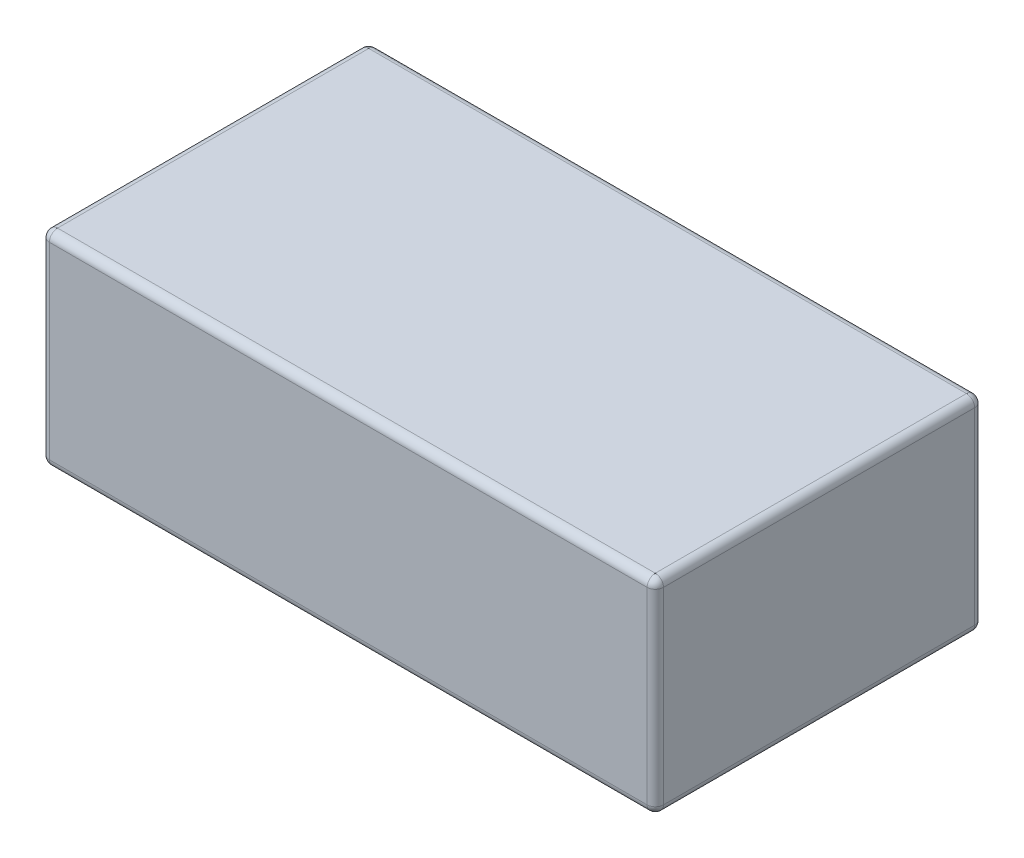
ISO-10303-21;
HEADER;
FILE_DESCRIPTION(('STEP AP214'),'2;1');
FILE_NAME('part.step','',(''),(''),'','','');
FILE_SCHEMA(('AUTOMOTIVE_DESIGN { 1 0 10303 214 1 1 1 1 }'));
ENDSEC;
DATA;
#1=APPLICATION_CONTEXT('core data for automotive mechanical design processes');
#2=APPLICATION_PROTOCOL_DEFINITION('international standard','automotive_design',2000,#1);
#3=PRODUCT_CONTEXT('',#1,'mechanical');
#4=PRODUCT('Part','Part','',(#3));
#5=PRODUCT_RELATED_PRODUCT_CATEGORY('part','',(#4));
#6=PRODUCT_DEFINITION_FORMATION('','',#4);
#7=PRODUCT_DEFINITION_CONTEXT('part definition',#1,'design');
#8=PRODUCT_DEFINITION('design','',#6,#7);
#9=PRODUCT_DEFINITION_SHAPE('','',#8);
#10=(LENGTH_UNIT() NAMED_UNIT(*) SI_UNIT(.MILLI.,.METRE.));
#11=(NAMED_UNIT(*) PLANE_ANGLE_UNIT() SI_UNIT($,.RADIAN.));
#12=(NAMED_UNIT(*) SI_UNIT($,.STERADIAN.) SOLID_ANGLE_UNIT());
#13=UNCERTAINTY_MEASURE_WITH_UNIT(LENGTH_MEASURE(1.E-05),#10,'distance_accuracy_value','');
#14=(GEOMETRIC_REPRESENTATION_CONTEXT(3) GLOBAL_UNCERTAINTY_ASSIGNED_CONTEXT((#13)) GLOBAL_UNIT_ASSIGNED_CONTEXT((#10,
#11,#12)) REPRESENTATION_CONTEXT('',''));
#15=CARTESIAN_POINT('',(0.,0.,0.));
#16=DIRECTION('',(0.,0.,1.));
#17=DIRECTION('',(1.,0.,0.));
#18=AXIS2_PLACEMENT_3D('',#15,#16,#17);
#19=CARTESIAN_POINT('',(-0.73,0.25,0.38));
#20=DIRECTION('',(0.,-1.,0.));
#21=DIRECTION('',(0.,0.,-1.));
#22=AXIS2_PLACEMENT_3D('',#19,#20,#21);
#23=CYLINDRICAL_SURFACE('',#22,0.02);
#24=DIRECTION('',(0.,-1.,0.));
#25=VECTOR('',#24,1.);
#26=CARTESIAN_POINT('',(-0.73,0.25,0.4));
#27=LINE('',#26,#25);
#28=CARTESIAN_POINT('',(-0.73,0.23,0.4));
#29=VERTEX_POINT('',#28);
#30=CARTESIAN_POINT('',(-0.73,-0.23,0.4));
#31=VERTEX_POINT('',#30);
#32=EDGE_CURVE('E153',#29,#31,#27,.T.);
#33=ORIENTED_EDGE('',*,*,#32,.F.);
#34=CARTESIAN_POINT('',(-0.73,0.23,0.38));
#35=DIRECTION('',(0.,-1.,0.));
#36=DIRECTION('',(0.,0.,-1.));
#37=AXIS2_PLACEMENT_3D('',#34,#35,#36);
#38=CIRCLE('',#37,0.02);
#39=CARTESIAN_POINT('',(-0.75,0.23,0.38));
#40=VERTEX_POINT('',#39);
#41=EDGE_CURVE('E140',#29,#40,#38,.T.);
#42=ORIENTED_EDGE('',*,*,#41,.T.);
#43=DIRECTION('',(0.,-1.,0.));
#44=VECTOR('',#43,1.);
#45=CARTESIAN_POINT('',(-0.75,0.25,0.38));
#46=LINE('',#45,#44);
#47=CARTESIAN_POINT('',(-0.75,-0.23,0.38));
#48=VERTEX_POINT('',#47);
#49=EDGE_CURVE('E211',#40,#48,#46,.T.);
#50=ORIENTED_EDGE('',*,*,#49,.T.);
#51=CARTESIAN_POINT('',(-0.73,-0.23,0.38));
#52=DIRECTION('',(0.,-1.,0.));
#53=DIRECTION('',(0.,0.,-1.));
#54=AXIS2_PLACEMENT_3D('',#51,#52,#53);
#55=CIRCLE('',#54,0.02);
#56=EDGE_CURVE('E191',#48,#31,#55,.F.);
#57=ORIENTED_EDGE('',*,*,#56,.T.);
#58=EDGE_LOOP('',(#33,#42,#50,#57));
#59=FACE_BOUND('',#58,.T.);
#60=ADVANCED_FACE('F35',(#59),#23,.T.);
#61=CARTESIAN_POINT('',(-0.73,0.25,0.4));
#62=DIRECTION('',(0.,0.,-1.));
#63=DIRECTION('',(-1.,0.,0.));
#64=AXIS2_PLACEMENT_3D('',#61,#62,#63);
#65=PLANE('',#64);
#66=DIRECTION('',(0.,-1.,0.));
#67=VECTOR('',#66,1.);
#68=CARTESIAN_POINT('',(0.73,0.25,0.4));
#69=LINE('',#68,#67);
#70=CARTESIAN_POINT('',(0.73,0.23,0.4));
#71=VERTEX_POINT('',#70);
#72=CARTESIAN_POINT('',(0.73,-0.23,0.4));
#73=VERTEX_POINT('',#72);
#74=EDGE_CURVE('E271',#71,#73,#69,.T.);
#75=ORIENTED_EDGE('',*,*,#74,.F.);
#76=DIRECTION('',(1.,0.,0.));
#77=VECTOR('',#76,1.);
#78=CARTESIAN_POINT('',(-0.73,0.23,0.4));
#79=LINE('',#78,#77);
#80=EDGE_CURVE('E189',#71,#29,#79,.F.);
#81=ORIENTED_EDGE('',*,*,#80,.T.);
#82=ORIENTED_EDGE('',*,*,#32,.T.);
#83=DIRECTION('',(1.,0.,0.));
#84=VECTOR('',#83,1.);
#85=CARTESIAN_POINT('',(-0.73,-0.23,0.4));
#86=LINE('',#85,#84);
#87=EDGE_CURVE('E186',#31,#73,#86,.T.);
#88=ORIENTED_EDGE('',*,*,#87,.T.);
#89=EDGE_LOOP('',(#75,#81,#82,#88));
#90=FACE_BOUND('',#89,.T.);
#91=ADVANCED_FACE('F313',(#90),#65,.F.);
#92=CARTESIAN_POINT('',(0.73,0.25,0.38));
#93=DIRECTION('',(0.,-1.,0.));
#94=DIRECTION('',(0.,0.,-1.));
#95=AXIS2_PLACEMENT_3D('',#92,#93,#94);
#96=CYLINDRICAL_SURFACE('',#95,0.0200000000000001);
#97=DIRECTION('',(0.,-1.,0.));
#98=VECTOR('',#97,1.);
#99=CARTESIAN_POINT('',(0.75,0.25,0.38));
#100=LINE('',#99,#98);
#101=CARTESIAN_POINT('',(0.75,0.23,0.38));
#102=VERTEX_POINT('',#101);
#103=CARTESIAN_POINT('',(0.75,-0.23,0.38));
#104=VERTEX_POINT('',#103);
#105=EDGE_CURVE('E268',#102,#104,#100,.T.);
#106=ORIENTED_EDGE('',*,*,#105,.F.);
#107=CARTESIAN_POINT('',(0.73,0.23,0.38));
#108=DIRECTION('',(0.,-1.,0.));
#109=DIRECTION('',(0.,0.,-1.));
#110=AXIS2_PLACEMENT_3D('',#107,#108,#109);
#111=CIRCLE('',#110,0.0200000000000001);
#112=EDGE_CURVE('E184',#102,#71,#111,.T.);
#113=ORIENTED_EDGE('',*,*,#112,.T.);
#114=ORIENTED_EDGE('',*,*,#74,.T.);
#115=CARTESIAN_POINT('',(0.73,-0.23,0.38));
#116=DIRECTION('',(0.,-1.,0.));
#117=DIRECTION('',(0.,0.,-1.));
#118=AXIS2_PLACEMENT_3D('',#115,#116,#117);
#119=CIRCLE('',#118,0.0200000000000001);
#120=EDGE_CURVE('E182',#73,#104,#119,.F.);
#121=ORIENTED_EDGE('',*,*,#120,.T.);
#122=EDGE_LOOP('',(#106,#113,#114,#121));
#123=FACE_BOUND('',#122,.T.);
#124=ADVANCED_FACE('F314',(#123),#96,.T.);
#125=CARTESIAN_POINT('',(0.75,0.25,0.38));
#126=DIRECTION('',(-1.,0.,0.));
#127=DIRECTION('',(0.,0.,1.));
#128=AXIS2_PLACEMENT_3D('',#125,#126,#127);
#129=PLANE('',#128);
#130=DIRECTION('',(0.,-1.,0.));
#131=VECTOR('',#130,1.);
#132=CARTESIAN_POINT('',(0.75,0.25,-0.38));
#133=LINE('',#132,#131);
#134=CARTESIAN_POINT('',(0.75,0.23,-0.38));
#135=VERTEX_POINT('',#134);
#136=CARTESIAN_POINT('',(0.75,-0.23,-0.38));
#137=VERTEX_POINT('',#136);
#138=EDGE_CURVE('E265',#135,#137,#133,.T.);
#139=ORIENTED_EDGE('',*,*,#138,.F.);
#140=DIRECTION('',(0.,0.,-1.));
#141=VECTOR('',#140,1.);
#142=CARTESIAN_POINT('',(0.75,0.23,0.38));
#143=LINE('',#142,#141);
#144=EDGE_CURVE('E180',#135,#102,#143,.F.);
#145=ORIENTED_EDGE('',*,*,#144,.T.);
#146=ORIENTED_EDGE('',*,*,#105,.T.);
#147=DIRECTION('',(0.,0.,-1.));
#148=VECTOR('',#147,1.);
#149=CARTESIAN_POINT('',(0.75,-0.23,0.38));
#150=LINE('',#149,#148);
#151=EDGE_CURVE('E178',#104,#137,#150,.T.);
#152=ORIENTED_EDGE('',*,*,#151,.T.);
#153=EDGE_LOOP('',(#139,#145,#146,#152));
#154=FACE_BOUND('',#153,.T.);
#155=ADVANCED_FACE('F496',(#154),#129,.F.);
#156=CARTESIAN_POINT('',(0.73,0.25,-0.38));
#157=DIRECTION('',(0.,-1.,0.));
#158=DIRECTION('',(0.,0.,-1.));
#159=AXIS2_PLACEMENT_3D('',#156,#157,#158);
#160=CYLINDRICAL_SURFACE('',#159,0.0200000000000001);
#161=DIRECTION('',(0.,-1.,0.));
#162=VECTOR('',#161,1.);
#163=CARTESIAN_POINT('',(0.73,0.25,-0.4));
#164=LINE('',#163,#162);
#165=CARTESIAN_POINT('',(0.73,0.23,-0.4));
#166=VERTEX_POINT('',#165);
#167=CARTESIAN_POINT('',(0.73,-0.23,-0.4));
#168=VERTEX_POINT('',#167);
#169=EDGE_CURVE('E262',#166,#168,#164,.T.);
#170=ORIENTED_EDGE('',*,*,#169,.F.);
#171=CARTESIAN_POINT('',(0.73,0.23,-0.38));
#172=DIRECTION('',(0.,-1.,0.));
#173=DIRECTION('',(0.,0.,-1.));
#174=AXIS2_PLACEMENT_3D('',#171,#172,#173);
#175=CIRCLE('',#174,0.0200000000000001);
#176=EDGE_CURVE('E176',#166,#135,#175,.T.);
#177=ORIENTED_EDGE('',*,*,#176,.T.);
#178=ORIENTED_EDGE('',*,*,#138,.T.);
#179=CARTESIAN_POINT('',(0.73,-0.23,-0.38));
#180=DIRECTION('',(0.,-1.,0.));
#181=DIRECTION('',(0.,0.,-1.));
#182=AXIS2_PLACEMENT_3D('',#179,#180,#181);
#183=CIRCLE('',#182,0.0200000000000001);
#184=EDGE_CURVE('E174',#137,#168,#183,.F.);
#185=ORIENTED_EDGE('',*,*,#184,.T.);
#186=EDGE_LOOP('',(#170,#177,#178,#185));
#187=FACE_BOUND('',#186,.T.);
#188=ADVANCED_FACE('F488',(#187),#160,.T.);
#189=CARTESIAN_POINT('',(-0.73,0.25,-0.4));
#190=DIRECTION('',(0.,0.,1.));
#191=DIRECTION('',(1.,0.,0.));
#192=AXIS2_PLACEMENT_3D('',#189,#190,#191);
#193=PLANE('',#192);
#194=DIRECTION('',(0.,-1.,0.));
#195=VECTOR('',#194,1.);
#196=CARTESIAN_POINT('',(-0.73,0.25,-0.4));
#197=LINE('',#196,#195);
#198=CARTESIAN_POINT('',(-0.73,0.23,-0.4));
#199=VERTEX_POINT('',#198);
#200=CARTESIAN_POINT('',(-0.73,-0.23,-0.4));
#201=VERTEX_POINT('',#200);
#202=EDGE_CURVE('E257',#199,#201,#197,.T.);
#203=ORIENTED_EDGE('',*,*,#202,.F.);
#204=DIRECTION('',(-1.,0.,0.));
#205=VECTOR('',#204,1.);
#206=CARTESIAN_POINT('',(0.73,0.23,-0.4));
#207=LINE('',#206,#205);
#208=EDGE_CURVE('E172',#199,#166,#207,.F.);
#209=ORIENTED_EDGE('',*,*,#208,.T.);
#210=ORIENTED_EDGE('',*,*,#169,.T.);
#211=DIRECTION('',(-1.,0.,0.));
#212=VECTOR('',#211,1.);
#213=CARTESIAN_POINT('',(-0.73,-0.23,-0.4));
#214=LINE('',#213,#212);
#215=EDGE_CURVE('E170',#168,#201,#214,.T.);
#216=ORIENTED_EDGE('',*,*,#215,.T.);
#217=EDGE_LOOP('',(#203,#209,#210,#216));
#218=FACE_BOUND('',#217,.T.);
#219=ADVANCED_FACE('F294',(#218),#193,.F.);
#220=CARTESIAN_POINT('',(-0.73,0.25,-0.38));
#221=DIRECTION('',(0.,-1.,0.));
#222=DIRECTION('',(0.,0.,-1.));
#223=AXIS2_PLACEMENT_3D('',#220,#221,#222);
#224=CYLINDRICAL_SURFACE('',#223,0.02);
#225=DIRECTION('',(0.,-1.,0.));
#226=VECTOR('',#225,1.);
#227=CARTESIAN_POINT('',(-0.75,0.25,-0.38));
#228=LINE('',#227,#226);
#229=CARTESIAN_POINT('',(-0.75,0.23,-0.38));
#230=VERTEX_POINT('',#229);
#231=CARTESIAN_POINT('',(-0.75,-0.23,-0.38));
#232=VERTEX_POINT('',#231);
#233=EDGE_CURVE('E252',#230,#232,#228,.T.);
#234=ORIENTED_EDGE('',*,*,#233,.F.);
#235=CARTESIAN_POINT('',(-0.73,0.23,-0.38));
#236=DIRECTION('',(0.,-1.,0.));
#237=DIRECTION('',(0.,0.,-1.));
#238=AXIS2_PLACEMENT_3D('',#235,#236,#237);
#239=CIRCLE('',#238,0.02);
#240=EDGE_CURVE('E168',#230,#199,#239,.T.);
#241=ORIENTED_EDGE('',*,*,#240,.T.);
#242=ORIENTED_EDGE('',*,*,#202,.T.);
#243=CARTESIAN_POINT('',(-0.73,-0.23,-0.38));
#244=DIRECTION('',(0.,-1.,0.));
#245=DIRECTION('',(0.,0.,-1.));
#246=AXIS2_PLACEMENT_3D('',#243,#244,#245);
#247=CIRCLE('',#246,0.02);
#248=EDGE_CURVE('E166',#201,#232,#247,.F.);
#249=ORIENTED_EDGE('',*,*,#248,.T.);
#250=EDGE_LOOP('',(#234,#241,#242,#249));
#251=FACE_BOUND('',#250,.T.);
#252=ADVANCED_FACE('F292',(#251),#224,.T.);
#253=CARTESIAN_POINT('',(-0.75,0.25,0.38));
#254=DIRECTION('',(1.,0.,0.));
#255=DIRECTION('',(0.,0.,-1.));
#256=AXIS2_PLACEMENT_3D('',#253,#254,#255);
#257=PLANE('',#256);
#258=ORIENTED_EDGE('',*,*,#49,.F.);
#259=DIRECTION('',(0.,0.,1.));
#260=VECTOR('',#259,1.);
#261=CARTESIAN_POINT('',(-0.75,0.23,-0.38));
#262=LINE('',#261,#260);
#263=EDGE_CURVE('E131',#40,#230,#262,.F.);
#264=ORIENTED_EDGE('',*,*,#263,.T.);
#265=ORIENTED_EDGE('',*,*,#233,.T.);
#266=DIRECTION('',(0.,0.,1.));
#267=VECTOR('',#266,1.);
#268=CARTESIAN_POINT('',(-0.75,-0.23,0.38));
#269=LINE('',#268,#267);
#270=EDGE_CURVE('E159',#232,#48,#269,.T.);
#271=ORIENTED_EDGE('',*,*,#270,.T.);
#272=EDGE_LOOP('',(#258,#264,#265,#271));
#273=FACE_BOUND('',#272,.T.);
#274=ADVANCED_FACE('F250',(#273),#257,.F.);
#275=CARTESIAN_POINT('',(-0.73,0.25,0.38));
#276=DIRECTION('',(0.,1.,0.));
#277=DIRECTION('',(0.,0.,1.));
#278=AXIS2_PLACEMENT_3D('',#275,#276,#277);
#279=PLANE('',#278);
#280=DIRECTION('',(-1.,0.,0.));
#281=VECTOR('',#280,1.);
#282=CARTESIAN_POINT('',(-0.73,0.25,-0.38));
#283=LINE('',#282,#281);
#284=CARTESIAN_POINT('',(0.73,0.25,-0.38));
#285=VERTEX_POINT('',#284);
#286=CARTESIAN_POINT('',(-0.73,0.25,-0.38));
#287=VERTEX_POINT('',#286);
#288=EDGE_CURVE('E157',#285,#287,#283,.T.);
#289=ORIENTED_EDGE('',*,*,#288,.T.);
#290=DIRECTION('',(0.,0.,1.));
#291=VECTOR('',#290,1.);
#292=CARTESIAN_POINT('',(-0.73,0.25,0.38));
#293=LINE('',#292,#291);
#294=CARTESIAN_POINT('',(-0.73,0.25,0.38));
#295=VERTEX_POINT('',#294);
#296=EDGE_CURVE('E129',#287,#295,#293,.T.);
#297=ORIENTED_EDGE('',*,*,#296,.T.);
#298=DIRECTION('',(1.,0.,0.));
#299=VECTOR('',#298,1.);
#300=CARTESIAN_POINT('',(0.73,0.25,0.38));
#301=LINE('',#300,#299);
#302=CARTESIAN_POINT('',(0.73,0.25,0.38));
#303=VERTEX_POINT('',#302);
#304=EDGE_CURVE('E146',#295,#303,#301,.T.);
#305=ORIENTED_EDGE('',*,*,#304,.T.);
#306=DIRECTION('',(0.,0.,-1.));
#307=VECTOR('',#306,1.);
#308=CARTESIAN_POINT('',(0.73,0.25,-0.38));
#309=LINE('',#308,#307);
#310=EDGE_CURVE('E152',#303,#285,#309,.T.);
#311=ORIENTED_EDGE('',*,*,#310,.T.);
#312=EDGE_LOOP('',(#289,#297,#305,#311));
#313=FACE_BOUND('',#312,.T.);
#314=ADVANCED_FACE('F155',(#313),#279,.T.);
#315=CARTESIAN_POINT('',(-0.73,-0.25,0.38));
#316=DIRECTION('',(0.,1.,0.));
#317=DIRECTION('',(0.,0.,1.));
#318=AXIS2_PLACEMENT_3D('',#315,#316,#317);
#319=PLANE('',#318);
#320=DIRECTION('',(0.,0.,-1.));
#321=VECTOR('',#320,1.);
#322=CARTESIAN_POINT('',(0.73,-0.25,0.38));
#323=LINE('',#322,#321);
#324=CARTESIAN_POINT('',(0.73,-0.25,-0.38));
#325=VERTEX_POINT('',#324);
#326=CARTESIAN_POINT('',(0.73,-0.25,0.38));
#327=VERTEX_POINT('',#326);
#328=EDGE_CURVE('E44',#325,#327,#323,.F.);
#329=ORIENTED_EDGE('',*,*,#328,.T.);
#330=DIRECTION('',(1.,0.,0.));
#331=VECTOR('',#330,1.);
#332=CARTESIAN_POINT('',(-0.73,-0.25,0.38));
#333=LINE('',#332,#331);
#334=CARTESIAN_POINT('',(-0.73,-0.25,0.38));
#335=VERTEX_POINT('',#334);
#336=EDGE_CURVE('E11',#327,#335,#333,.F.);
#337=ORIENTED_EDGE('',*,*,#336,.T.);
#338=DIRECTION('',(0.,0.,1.));
#339=VECTOR('',#338,1.);
#340=CARTESIAN_POINT('',(-0.73,-0.25,0.38));
#341=LINE('',#340,#339);
#342=CARTESIAN_POINT('',(-0.73,-0.25,-0.38));
#343=VERTEX_POINT('',#342);
#344=EDGE_CURVE('E194',#335,#343,#341,.F.);
#345=ORIENTED_EDGE('',*,*,#344,.T.);
#346=DIRECTION('',(-1.,0.,0.));
#347=VECTOR('',#346,1.);
#348=CARTESIAN_POINT('',(-0.73,-0.25,-0.38));
#349=LINE('',#348,#347);
#350=EDGE_CURVE('E55',#343,#325,#349,.F.);
#351=ORIENTED_EDGE('',*,*,#350,.T.);
#352=EDGE_LOOP('',(#329,#337,#345,#351));
#353=FACE_BOUND('',#352,.T.);
#354=ADVANCED_FACE('F450',(#353),#319,.F.);
#355=CARTESIAN_POINT('',(0.73,0.23,0.38));
#356=DIRECTION('',(0.,0.,1.));
#357=DIRECTION('',(1.,0.,0.));
#358=AXIS2_PLACEMENT_3D('',#355,#356,#357);
#359=CYLINDRICAL_SURFACE('',#358,0.02);
#360=CARTESIAN_POINT('',(0.73,0.23,0.38));
#361=DIRECTION('',(0.,0.,1.));
#362=DIRECTION('',(1.,0.,0.));
#363=AXIS2_PLACEMENT_3D('',#360,#361,#362);
#364=CIRCLE('',#363,0.02);
#365=EDGE_CURVE('E205',#102,#303,#364,.T.);
#366=ORIENTED_EDGE('',*,*,#365,.F.);
#367=ORIENTED_EDGE('',*,*,#144,.F.);
#368=CARTESIAN_POINT('',(0.73,0.23,-0.38));
#369=DIRECTION('',(0.,0.,-1.));
#370=DIRECTION('',(-1.,0.,0.));
#371=AXIS2_PLACEMENT_3D('',#368,#369,#370);
#372=CIRCLE('',#371,0.02);
#373=EDGE_CURVE('E208',#285,#135,#372,.T.);
#374=ORIENTED_EDGE('',*,*,#373,.F.);
#375=ORIENTED_EDGE('',*,*,#310,.F.);
#376=EDGE_LOOP('',(#366,#367,#374,#375));
#377=FACE_BOUND('',#376,.T.);
#378=ADVANCED_FACE('F279',(#377),#359,.T.);
#379=CARTESIAN_POINT('',(0.73,0.23,-0.38));
#380=DIRECTION('',(0.,1.,0.));
#381=DIRECTION('',(0.,0.,1.));
#382=AXIS2_PLACEMENT_3D('',#379,#380,#381);
#383=SPHERICAL_SURFACE('',#382,0.02);
#384=ORIENTED_EDGE('',*,*,#373,.T.);
#385=ORIENTED_EDGE('',*,*,#176,.F.);
#386=CARTESIAN_POINT('',(0.73,0.23,-0.38));
#387=DIRECTION('',(-1.,0.,0.));
#388=DIRECTION('',(0.,0.,1.));
#389=AXIS2_PLACEMENT_3D('',#386,#387,#388);
#390=CIRCLE('',#389,0.02);
#391=EDGE_CURVE('E202',#285,#166,#390,.T.);
#392=ORIENTED_EDGE('',*,*,#391,.F.);
#393=EDGE_LOOP('',(#384,#385,#392));
#394=FACE_BOUND('',#393,.T.);
#395=ADVANCED_FACE('F282',(#394),#383,.T.);
#396=CARTESIAN_POINT('',(0.73,0.23,0.38));
#397=DIRECTION('',(0.,1.,0.));
#398=DIRECTION('',(0.,0.,1.));
#399=AXIS2_PLACEMENT_3D('',#396,#397,#398);
#400=SPHERICAL_SURFACE('',#399,0.02);
#401=ORIENTED_EDGE('',*,*,#112,.F.);
#402=ORIENTED_EDGE('',*,*,#365,.T.);
#403=CARTESIAN_POINT('',(0.73,0.23,0.38));
#404=DIRECTION('',(-1.,0.,0.));
#405=DIRECTION('',(0.,0.,1.));
#406=AXIS2_PLACEMENT_3D('',#403,#404,#405);
#407=CIRCLE('',#406,0.02);
#408=EDGE_CURVE('E149',#71,#303,#407,.T.);
#409=ORIENTED_EDGE('',*,*,#408,.F.);
#410=EDGE_LOOP('',(#401,#402,#409));
#411=FACE_BOUND('',#410,.T.);
#412=ADVANCED_FACE('F317',(#411),#400,.T.);
#413=CARTESIAN_POINT('',(-0.73,0.23,-0.38));
#414=DIRECTION('',(1.,0.,0.));
#415=DIRECTION('',(0.,0.,-1.));
#416=AXIS2_PLACEMENT_3D('',#413,#414,#415);
#417=CYLINDRICAL_SURFACE('',#416,0.02);
#418=ORIENTED_EDGE('',*,*,#391,.T.);
#419=ORIENTED_EDGE('',*,*,#208,.F.);
#420=CARTESIAN_POINT('',(-0.73,0.23,-0.38));
#421=DIRECTION('',(-1.,0.,0.));
#422=DIRECTION('',(0.,0.,1.));
#423=AXIS2_PLACEMENT_3D('',#420,#421,#422);
#424=CIRCLE('',#423,0.02);
#425=EDGE_CURVE('E143',#287,#199,#424,.T.);
#426=ORIENTED_EDGE('',*,*,#425,.F.);
#427=ORIENTED_EDGE('',*,*,#288,.F.);
#428=EDGE_LOOP('',(#418,#419,#426,#427));
#429=FACE_BOUND('',#428,.T.);
#430=ADVANCED_FACE('F285',(#429),#417,.T.);
#431=CARTESIAN_POINT('',(-0.73,0.23,0.38));
#432=DIRECTION('',(-1.,0.,0.));
#433=DIRECTION('',(0.,0.,1.));
#434=AXIS2_PLACEMENT_3D('',#431,#432,#433);
#435=CYLINDRICAL_SURFACE('',#434,0.02);
#436=ORIENTED_EDGE('',*,*,#408,.T.);
#437=ORIENTED_EDGE('',*,*,#304,.F.);
#438=CARTESIAN_POINT('',(-0.73,0.23,0.38));
#439=DIRECTION('',(-1.,0.,0.));
#440=DIRECTION('',(0.,0.,1.));
#441=AXIS2_PLACEMENT_3D('',#438,#439,#440);
#442=CIRCLE('',#441,0.02);
#443=EDGE_CURVE('E137',#29,#295,#442,.T.);
#444=ORIENTED_EDGE('',*,*,#443,.F.);
#445=ORIENTED_EDGE('',*,*,#80,.F.);
#446=EDGE_LOOP('',(#436,#437,#444,#445));
#447=FACE_BOUND('',#446,.T.);
#448=ADVANCED_FACE('F147',(#447),#435,.T.);
#449=CARTESIAN_POINT('',(-0.73,0.23,-0.38));
#450=DIRECTION('',(0.,1.,0.));
#451=DIRECTION('',(0.,0.,1.));
#452=AXIS2_PLACEMENT_3D('',#449,#450,#451);
#453=SPHERICAL_SURFACE('',#452,0.02);
#454=ORIENTED_EDGE('',*,*,#425,.T.);
#455=ORIENTED_EDGE('',*,*,#240,.F.);
#456=CARTESIAN_POINT('',(-0.73,0.23,-0.38));
#457=DIRECTION('',(0.,0.,1.));
#458=DIRECTION('',(1.,0.,0.));
#459=AXIS2_PLACEMENT_3D('',#456,#457,#458);
#460=CIRCLE('',#459,0.02);
#461=EDGE_CURVE('E134',#287,#230,#460,.T.);
#462=ORIENTED_EDGE('',*,*,#461,.F.);
#463=EDGE_LOOP('',(#454,#455,#462));
#464=FACE_BOUND('',#463,.T.);
#465=ADVANCED_FACE('F289',(#464),#453,.T.);
#466=CARTESIAN_POINT('',(-0.73,0.23,0.38));
#467=DIRECTION('',(0.,1.,0.));
#468=DIRECTION('',(0.,0.,1.));
#469=AXIS2_PLACEMENT_3D('',#466,#467,#468);
#470=SPHERICAL_SURFACE('',#469,0.02);
#471=ORIENTED_EDGE('',*,*,#41,.F.);
#472=ORIENTED_EDGE('',*,*,#443,.T.);
#473=CARTESIAN_POINT('',(-0.73,0.23,0.38));
#474=DIRECTION('',(0.,0.,-1.));
#475=DIRECTION('',(-1.,0.,0.));
#476=AXIS2_PLACEMENT_3D('',#473,#474,#475);
#477=CIRCLE('',#476,0.02);
#478=EDGE_CURVE('E125',#40,#295,#477,.T.);
#479=ORIENTED_EDGE('',*,*,#478,.F.);
#480=EDGE_LOOP('',(#471,#472,#479));
#481=FACE_BOUND('',#480,.T.);
#482=ADVANCED_FACE('F139',(#481),#470,.T.);
#483=CARTESIAN_POINT('',(-0.73,0.23,0.38));
#484=DIRECTION('',(0.,0.,-1.));
#485=DIRECTION('',(-1.,0.,0.));
#486=AXIS2_PLACEMENT_3D('',#483,#484,#485);
#487=CYLINDRICAL_SURFACE('',#486,0.02);
#488=ORIENTED_EDGE('',*,*,#461,.T.);
#489=ORIENTED_EDGE('',*,*,#263,.F.);
#490=ORIENTED_EDGE('',*,*,#478,.T.);
#491=ORIENTED_EDGE('',*,*,#296,.F.);
#492=EDGE_LOOP('',(#488,#489,#490,#491));
#493=FACE_BOUND('',#492,.T.);
#494=ADVANCED_FACE('F127',(#493),#487,.T.);
#495=CARTESIAN_POINT('',(-0.73,-0.23,-0.38));
#496=DIRECTION('',(-1.,0.,0.));
#497=DIRECTION('',(0.,0.,1.));
#498=AXIS2_PLACEMENT_3D('',#495,#496,#497);
#499=CYLINDRICAL_SURFACE('',#498,0.02);
#500=CARTESIAN_POINT('',(-0.73,-0.23,-0.38));
#501=DIRECTION('',(-1.,0.,0.));
#502=DIRECTION('',(0.,0.,1.));
#503=AXIS2_PLACEMENT_3D('',#500,#501,#502);
#504=CIRCLE('',#503,0.02);
#505=EDGE_CURVE('E39',#201,#343,#504,.T.);
#506=ORIENTED_EDGE('',*,*,#505,.F.);
#507=ORIENTED_EDGE('',*,*,#215,.F.);
#508=CARTESIAN_POINT('',(0.73,-0.23,-0.38));
#509=DIRECTION('',(1.,0.,0.));
#510=DIRECTION('',(0.,0.,-1.));
#511=AXIS2_PLACEMENT_3D('',#508,#509,#510);
#512=CIRCLE('',#511,0.02);
#513=EDGE_CURVE('E227',#325,#168,#512,.T.);
#514=ORIENTED_EDGE('',*,*,#513,.F.);
#515=ORIENTED_EDGE('',*,*,#350,.F.);
#516=EDGE_LOOP('',(#506,#507,#514,#515));
#517=FACE_BOUND('',#516,.T.);
#518=ADVANCED_FACE('F37',(#517),#499,.T.);
#519=CARTESIAN_POINT('',(-0.73,-0.23,-0.38));
#520=DIRECTION('',(0.,1.,0.));
#521=DIRECTION('',(0.,0.,1.));
#522=AXIS2_PLACEMENT_3D('',#519,#520,#521);
#523=SPHERICAL_SURFACE('',#522,0.02);
#524=ORIENTED_EDGE('',*,*,#248,.F.);
#525=ORIENTED_EDGE('',*,*,#505,.T.);
#526=CARTESIAN_POINT('',(-0.73,-0.23,-0.38));
#527=DIRECTION('',(0.,0.,1.));
#528=DIRECTION('',(1.,0.,0.));
#529=AXIS2_PLACEMENT_3D('',#526,#527,#528);
#530=CIRCLE('',#529,0.02);
#531=EDGE_CURVE('E225',#232,#343,#530,.T.);
#532=ORIENTED_EDGE('',*,*,#531,.F.);
#533=EDGE_LOOP('',(#524,#525,#532));
#534=FACE_BOUND('',#533,.T.);
#535=ADVANCED_FACE('F237',(#534),#523,.T.);
#536=CARTESIAN_POINT('',(0.73,-0.23,-0.38));
#537=DIRECTION('',(0.,1.,0.));
#538=DIRECTION('',(0.,0.,1.));
#539=AXIS2_PLACEMENT_3D('',#536,#537,#538);
#540=SPHERICAL_SURFACE('',#539,0.02);
#541=ORIENTED_EDGE('',*,*,#513,.T.);
#542=ORIENTED_EDGE('',*,*,#184,.F.);
#543=CARTESIAN_POINT('',(0.73,-0.23,-0.38));
#544=DIRECTION('',(0.,0.,1.));
#545=DIRECTION('',(1.,0.,0.));
#546=AXIS2_PLACEMENT_3D('',#543,#544,#545);
#547=CIRCLE('',#546,0.02);
#548=EDGE_CURVE('E222',#325,#137,#547,.T.);
#549=ORIENTED_EDGE('',*,*,#548,.F.);
#550=EDGE_LOOP('',(#541,#542,#549));
#551=FACE_BOUND('',#550,.T.);
#552=ADVANCED_FACE('F296',(#551),#540,.T.);
#553=CARTESIAN_POINT('',(-0.73,-0.23,0.38));
#554=DIRECTION('',(0.,0.,1.));
#555=DIRECTION('',(1.,0.,0.));
#556=AXIS2_PLACEMENT_3D('',#553,#554,#555);
#557=CYLINDRICAL_SURFACE('',#556,0.02);
#558=ORIENTED_EDGE('',*,*,#531,.T.);
#559=ORIENTED_EDGE('',*,*,#344,.F.);
#560=CARTESIAN_POINT('',(-0.73,-0.23,0.38));
#561=DIRECTION('',(0.,0.,1.));
#562=DIRECTION('',(1.,0.,0.));
#563=AXIS2_PLACEMENT_3D('',#560,#561,#562);
#564=CIRCLE('',#563,0.02);
#565=EDGE_CURVE('E219',#48,#335,#564,.T.);
#566=ORIENTED_EDGE('',*,*,#565,.F.);
#567=ORIENTED_EDGE('',*,*,#270,.F.);
#568=EDGE_LOOP('',(#558,#559,#566,#567));
#569=FACE_BOUND('',#568,.T.);
#570=ADVANCED_FACE('F243',(#569),#557,.T.);
#571=CARTESIAN_POINT('',(0.73,-0.23,0.38));
#572=DIRECTION('',(0.,0.,-1.));
#573=DIRECTION('',(-1.,0.,0.));
#574=AXIS2_PLACEMENT_3D('',#571,#572,#573);
#575=CYLINDRICAL_SURFACE('',#574,0.02);
#576=ORIENTED_EDGE('',*,*,#548,.T.);
#577=ORIENTED_EDGE('',*,*,#151,.F.);
#578=CARTESIAN_POINT('',(0.73,-0.23,0.38));
#579=DIRECTION('',(0.,0.,1.));
#580=DIRECTION('',(1.,0.,0.));
#581=AXIS2_PLACEMENT_3D('',#578,#579,#580);
#582=CIRCLE('',#581,0.02);
#583=EDGE_CURVE('E216',#327,#104,#582,.T.);
#584=ORIENTED_EDGE('',*,*,#583,.F.);
#585=ORIENTED_EDGE('',*,*,#328,.F.);
#586=EDGE_LOOP('',(#576,#577,#584,#585));
#587=FACE_BOUND('',#586,.T.);
#588=ADVANCED_FACE('F299',(#587),#575,.T.);
#589=CARTESIAN_POINT('',(-0.73,-0.23,0.38));
#590=DIRECTION('',(0.,1.,0.));
#591=DIRECTION('',(0.,0.,1.));
#592=AXIS2_PLACEMENT_3D('',#589,#590,#591);
#593=SPHERICAL_SURFACE('',#592,0.02);
#594=ORIENTED_EDGE('',*,*,#56,.F.);
#595=ORIENTED_EDGE('',*,*,#565,.T.);
#596=CARTESIAN_POINT('',(-0.73,-0.23,0.38));
#597=DIRECTION('',(1.,0.,0.));
#598=DIRECTION('',(0.,0.,-1.));
#599=AXIS2_PLACEMENT_3D('',#596,#597,#598);
#600=CIRCLE('',#599,0.02);
#601=EDGE_CURVE('E214',#31,#335,#600,.T.);
#602=ORIENTED_EDGE('',*,*,#601,.F.);
#603=EDGE_LOOP('',(#594,#595,#602));
#604=FACE_BOUND('',#603,.T.);
#605=ADVANCED_FACE('F385',(#604),#593,.T.);
#606=CARTESIAN_POINT('',(0.73,-0.23,0.38));
#607=DIRECTION('',(0.,1.,0.));
#608=DIRECTION('',(0.,0.,1.));
#609=AXIS2_PLACEMENT_3D('',#606,#607,#608);
#610=SPHERICAL_SURFACE('',#609,0.02);
#611=ORIENTED_EDGE('',*,*,#583,.T.);
#612=ORIENTED_EDGE('',*,*,#120,.F.);
#613=CARTESIAN_POINT('',(0.73,-0.23,0.38));
#614=DIRECTION('',(-1.,0.,0.));
#615=DIRECTION('',(0.,0.,1.));
#616=AXIS2_PLACEMENT_3D('',#613,#614,#615);
#617=CIRCLE('',#616,0.02);
#618=EDGE_CURVE('E212',#327,#73,#617,.T.);
#619=ORIENTED_EDGE('',*,*,#618,.F.);
#620=EDGE_LOOP('',(#611,#612,#619));
#621=FACE_BOUND('',#620,.T.);
#622=ADVANCED_FACE('F308',(#621),#610,.T.);
#623=CARTESIAN_POINT('',(-0.73,-0.23,0.38));
#624=DIRECTION('',(1.,0.,0.));
#625=DIRECTION('',(0.,0.,-1.));
#626=AXIS2_PLACEMENT_3D('',#623,#624,#625);
#627=CYLINDRICAL_SURFACE('',#626,0.02);
#628=ORIENTED_EDGE('',*,*,#601,.T.);
#629=ORIENTED_EDGE('',*,*,#336,.F.);
#630=ORIENTED_EDGE('',*,*,#618,.T.);
#631=ORIENTED_EDGE('',*,*,#87,.F.);
#632=EDGE_LOOP('',(#628,#629,#630,#631));
#633=FACE_BOUND('',#632,.T.);
#634=ADVANCED_FACE('F305',(#633),#627,.T.);
#635=CLOSED_SHELL('',(#60,#91,#124,#155,#188,#219,#252,#274,#314,#354,#378,#395,#412,#430,#448,
#465,#482,#494,#518,#535,#552,#570,#588,#605,#622,#634));
#636=MANIFOLD_SOLID_BREP('B2',#635);
#637=ADVANCED_BREP_SHAPE_REPRESENTATION('',(#18,#636),#14);
#638=SHAPE_DEFINITION_REPRESENTATION(#9,#637);
ENDSEC;
END-ISO-10303-21;
